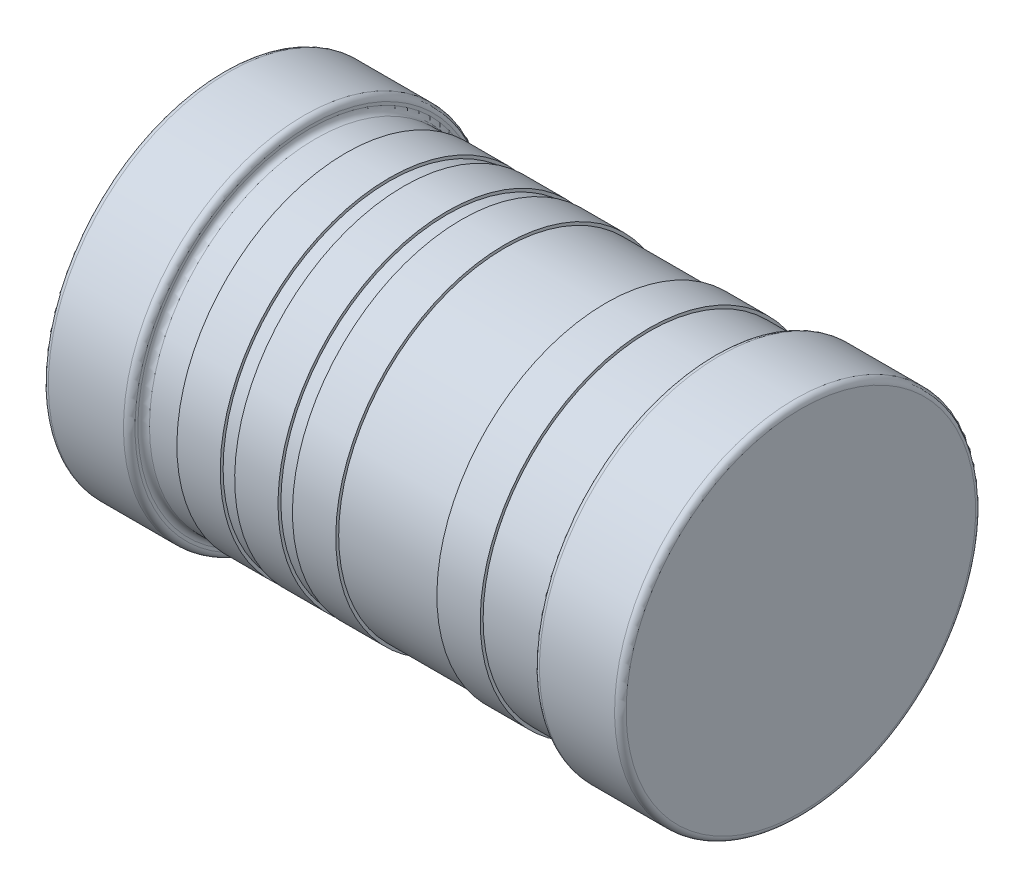
ISO-10303-21;
HEADER;
FILE_DESCRIPTION(('STEP AP214'),'2;1');
FILE_NAME('part.step','',(''),(''),'','','');
FILE_SCHEMA(('AUTOMOTIVE_DESIGN { 1 0 10303 214 1 1 1 1 }'));
ENDSEC;
DATA;
#1=APPLICATION_CONTEXT('core data for automotive mechanical design processes');
#2=APPLICATION_PROTOCOL_DEFINITION('international standard','automotive_design',2000,#1);
#3=PRODUCT_CONTEXT('',#1,'mechanical');
#4=PRODUCT('Part','Part','',(#3));
#5=PRODUCT_RELATED_PRODUCT_CATEGORY('part','',(#4));
#6=PRODUCT_DEFINITION_FORMATION('','',#4);
#7=PRODUCT_DEFINITION_CONTEXT('part definition',#1,'design');
#8=PRODUCT_DEFINITION('design','',#6,#7);
#9=PRODUCT_DEFINITION_SHAPE('','',#8);
#10=(LENGTH_UNIT() NAMED_UNIT(*) SI_UNIT(.MILLI.,.METRE.));
#11=(NAMED_UNIT(*) PLANE_ANGLE_UNIT() SI_UNIT($,.RADIAN.));
#12=(NAMED_UNIT(*) SI_UNIT($,.STERADIAN.) SOLID_ANGLE_UNIT());
#13=UNCERTAINTY_MEASURE_WITH_UNIT(LENGTH_MEASURE(1.E-05),#10,'distance_accuracy_value','');
#14=(GEOMETRIC_REPRESENTATION_CONTEXT(3) GLOBAL_UNCERTAINTY_ASSIGNED_CONTEXT((#13)) GLOBAL_UNIT_ASSIGNED_CONTEXT((#10,
#11,#12)) REPRESENTATION_CONTEXT('',''));
#15=CARTESIAN_POINT('',(0.,0.,0.));
#16=DIRECTION('',(0.,0.,1.));
#17=DIRECTION('',(1.,0.,0.));
#18=AXIS2_PLACEMENT_3D('',#15,#16,#17);
#19=CARTESIAN_POINT('',(-1.,0.0200000000000001,0.));
#20=DIRECTION('',(1.,0.,0.));
#21=DIRECTION('',(0.,1.,0.));
#22=AXIS2_PLACEMENT_3D('',#19,#20,#21);
#23=PLANE('',#22);
#24=CARTESIAN_POINT('',(-1.,0.625,0.));
#25=DIRECTION('',(1.,0.,0.));
#26=DIRECTION('',(0.,1.,0.));
#27=AXIS2_PLACEMENT_3D('',#24,#25,#26);
#28=CIRCLE('',#27,0.605);
#29=CARTESIAN_POINT('',(-1.,1.23,0.));
#30=VERTEX_POINT('',#29);
#31=EDGE_CURVE('E121',#30,#30,#28,.T.);
#32=ORIENTED_EDGE('',*,*,#31,.F.);
#33=EDGE_LOOP('',(#32));
#34=FACE_BOUND('',#33,.T.);
#35=ADVANCED_FACE('F33',(#34),#23,.F.);
#36=CARTESIAN_POINT('',(1.,0.625,0.));
#37=DIRECTION('',(-1.,0.,0.));
#38=DIRECTION('',(0.,-1.,0.));
#39=AXIS2_PLACEMENT_3D('',#36,#37,#38);
#40=PLANE('',#39);
#41=CARTESIAN_POINT('',(1.,0.625,0.));
#42=DIRECTION('',(1.,0.,0.));
#43=DIRECTION('',(0.,1.,0.));
#44=AXIS2_PLACEMENT_3D('',#41,#42,#43);
#45=CIRCLE('',#44,0.605);
#46=CARTESIAN_POINT('',(1.,1.23,0.));
#47=VERTEX_POINT('',#46);
#48=EDGE_CURVE('E10',#47,#47,#45,.T.);
#49=ORIENTED_EDGE('',*,*,#48,.T.);
#50=EDGE_LOOP('',(#49));
#51=FACE_BOUND('',#50,.T.);
#52=ADVANCED_FACE('F128',(#51),#40,.F.);
#53=CARTESIAN_POINT('',(0.98,0.625,0.));
#54=DIRECTION('',(1.,0.,0.));
#55=DIRECTION('',(0.,1.,0.));
#56=AXIS2_PLACEMENT_3D('',#53,#54,#55);
#57=TOROIDAL_SURFACE('',#56,0.605,0.0200000000000001);
#58=ORIENTED_EDGE('',*,*,#48,.F.);
#59=EDGE_LOOP('',(#58));
#60=FACE_BOUND('',#59,.T.);
#61=CARTESIAN_POINT('',(0.980000000000001,0.625,0.));
#62=DIRECTION('',(1.,0.,0.));
#63=DIRECTION('',(0.,1.,0.));
#64=AXIS2_PLACEMENT_3D('',#61,#62,#63);
#65=CIRCLE('',#64,0.625);
#66=CARTESIAN_POINT('',(0.980000000000001,1.25,0.));
#67=VERTEX_POINT('',#66);
#68=EDGE_CURVE('E39',#67,#67,#65,.T.);
#69=ORIENTED_EDGE('',*,*,#68,.T.);
#70=EDGE_LOOP('',(#69));
#71=FACE_BOUND('',#70,.T.);
#72=ADVANCED_FACE('F132',(#60,#71),#57,.T.);
#73=CARTESIAN_POINT('',(-1.,0.625,0.));
#74=DIRECTION('',(1.,0.,0.));
#75=DIRECTION('',(0.,1.,0.));
#76=AXIS2_PLACEMENT_3D('',#73,#74,#75);
#77=CYLINDRICAL_SURFACE('',#76,0.625);
#78=ORIENTED_EDGE('',*,*,#68,.F.);
#79=EDGE_LOOP('',(#78));
#80=FACE_BOUND('',#79,.T.);
#81=CARTESIAN_POINT('',(0.72,0.625,0.));
#82=DIRECTION('',(1.,0.,0.));
#83=DIRECTION('',(0.,1.,0.));
#84=AXIS2_PLACEMENT_3D('',#81,#82,#83);
#85=CIRCLE('',#84,0.625);
#86=CARTESIAN_POINT('',(0.72,1.25,0.));
#87=VERTEX_POINT('',#86);
#88=EDGE_CURVE('E43',#87,#87,#85,.T.);
#89=ORIENTED_EDGE('',*,*,#88,.T.);
#90=EDGE_LOOP('',(#89));
#91=FACE_BOUND('',#90,.T.);
#92=ADVANCED_FACE('F136',(#80,#91),#77,.T.);
#93=CARTESIAN_POINT('',(0.72,0.625,0.));
#94=DIRECTION('',(1.,0.,0.));
#95=DIRECTION('',(0.,1.,0.));
#96=AXIS2_PLACEMENT_3D('',#93,#94,#95);
#97=TOROIDAL_SURFACE('',#96,0.605,0.02);
#98=ORIENTED_EDGE('',*,*,#88,.F.);
#99=EDGE_LOOP('',(#98));
#100=FACE_BOUND('',#99,.T.);
#101=CARTESIAN_POINT('',(0.7,0.625,0.));
#102=DIRECTION('',(1.,0.,0.));
#103=DIRECTION('',(0.,1.,0.));
#104=AXIS2_PLACEMENT_3D('',#101,#102,#103);
#105=CIRCLE('',#104,0.605);
#106=CARTESIAN_POINT('',(0.7,1.23,0.));
#107=VERTEX_POINT('',#106);
#108=EDGE_CURVE('E47',#107,#107,#105,.T.);
#109=ORIENTED_EDGE('',*,*,#108,.T.);
#110=EDGE_LOOP('',(#109));
#111=FACE_BOUND('',#110,.T.);
#112=ADVANCED_FACE('F142',(#100,#111),#97,.T.);
#113=CARTESIAN_POINT('',(0.7,0.03,0.));
#114=DIRECTION('',(1.,0.,0.));
#115=DIRECTION('',(0.,1.,0.));
#116=AXIS2_PLACEMENT_3D('',#113,#114,#115);
#117=PLANE('',#116);
#118=ORIENTED_EDGE('',*,*,#108,.F.);
#119=EDGE_LOOP('',(#118));
#120=FACE_BOUND('',#119,.T.);
#121=CARTESIAN_POINT('',(0.7,0.625,0.));
#122=DIRECTION('',(1.,0.,0.));
#123=DIRECTION('',(0.,1.,0.));
#124=AXIS2_PLACEMENT_3D('',#121,#122,#123);
#125=CIRCLE('',#124,0.595);
#126=CARTESIAN_POINT('',(0.7,1.22,0.));
#127=VERTEX_POINT('',#126);
#128=EDGE_CURVE('E52',#127,#127,#125,.T.);
#129=ORIENTED_EDGE('',*,*,#128,.T.);
#130=EDGE_LOOP('',(#129));
#131=FACE_BOUND('',#130,.T.);
#132=ADVANCED_FACE('F146',(#120,#131),#117,.F.);
#133=CARTESIAN_POINT('',(0.68,0.625,0.));
#134=DIRECTION('',(1.,0.,0.));
#135=DIRECTION('',(0.,1.,0.));
#136=AXIS2_PLACEMENT_3D('',#133,#134,#135);
#137=TOROIDAL_SURFACE('',#136,0.595,0.02);
#138=ORIENTED_EDGE('',*,*,#128,.F.);
#139=EDGE_LOOP('',(#138));
#140=FACE_BOUND('',#139,.T.);
#141=CARTESIAN_POINT('',(0.68,0.625,0.));
#142=DIRECTION('',(1.,0.,0.));
#143=DIRECTION('',(0.,1.,0.));
#144=AXIS2_PLACEMENT_3D('',#141,#142,#143);
#145=CIRCLE('',#144,0.575);
#146=CARTESIAN_POINT('',(0.68,1.2,0.));
#147=VERTEX_POINT('',#146);
#148=EDGE_CURVE('E55',#147,#147,#145,.T.);
#149=ORIENTED_EDGE('',*,*,#148,.T.);
#150=EDGE_LOOP('',(#149));
#151=FACE_BOUND('',#150,.T.);
#152=ADVANCED_FACE('F150',(#140,#151),#137,.F.);
#153=CARTESIAN_POINT('',(-1.,0.625,0.));
#154=DIRECTION('',(1.,0.,0.));
#155=DIRECTION('',(0.,1.,0.));
#156=AXIS2_PLACEMENT_3D('',#153,#154,#155);
#157=CYLINDRICAL_SURFACE('',#156,0.575);
#158=ORIENTED_EDGE('',*,*,#148,.F.);
#159=EDGE_LOOP('',(#158));
#160=FACE_BOUND('',#159,.T.);
#161=CARTESIAN_POINT('',(0.475,0.625,0.));
#162=DIRECTION('',(1.,0.,0.));
#163=DIRECTION('',(0.,1.,0.));
#164=AXIS2_PLACEMENT_3D('',#161,#162,#163);
#165=CIRCLE('',#164,0.575);
#166=CARTESIAN_POINT('',(0.475,1.2,0.));
#167=VERTEX_POINT('',#166);
#168=EDGE_CURVE('E58',#167,#167,#165,.T.);
#169=ORIENTED_EDGE('',*,*,#168,.T.);
#170=EDGE_LOOP('',(#169));
#171=FACE_BOUND('',#170,.T.);
#172=ADVANCED_FACE('F154',(#160,#171),#157,.T.);
#173=CARTESIAN_POINT('',(0.475,0.05,0.));
#174=DIRECTION('',(-1.,0.,0.));
#175=DIRECTION('',(0.,-1.,0.));
#176=AXIS2_PLACEMENT_3D('',#173,#174,#175);
#177=PLANE('',#176);
#178=ORIENTED_EDGE('',*,*,#168,.F.);
#179=EDGE_LOOP('',(#178));
#180=FACE_BOUND('',#179,.T.);
#181=CARTESIAN_POINT('',(0.475,0.625,0.));
#182=DIRECTION('',(1.,0.,0.));
#183=DIRECTION('',(0.,1.,0.));
#184=AXIS2_PLACEMENT_3D('',#181,#182,#183);
#185=CIRCLE('',#184,0.585);
#186=CARTESIAN_POINT('',(0.475,1.21,0.));
#187=VERTEX_POINT('',#186);
#188=EDGE_CURVE('E61',#187,#187,#185,.T.);
#189=ORIENTED_EDGE('',*,*,#188,.T.);
#190=EDGE_LOOP('',(#189));
#191=FACE_BOUND('',#190,.T.);
#192=ADVANCED_FACE('F158',(#180,#191),#177,.F.);
#193=CARTESIAN_POINT('',(-1.,0.625,0.));
#194=DIRECTION('',(1.,0.,0.));
#195=DIRECTION('',(0.,1.,0.));
#196=AXIS2_PLACEMENT_3D('',#193,#194,#195);
#197=CYLINDRICAL_SURFACE('',#196,0.585);
#198=ORIENTED_EDGE('',*,*,#188,.F.);
#199=EDGE_LOOP('',(#198));
#200=FACE_BOUND('',#199,.T.);
#201=CARTESIAN_POINT('',(0.325,0.625,0.));
#202=DIRECTION('',(1.,0.,0.));
#203=DIRECTION('',(0.,1.,0.));
#204=AXIS2_PLACEMENT_3D('',#201,#202,#203);
#205=CIRCLE('',#204,0.585);
#206=CARTESIAN_POINT('',(0.325,1.21,0.));
#207=VERTEX_POINT('',#206);
#208=EDGE_CURVE('E64',#207,#207,#205,.T.);
#209=ORIENTED_EDGE('',*,*,#208,.T.);
#210=EDGE_LOOP('',(#209));
#211=FACE_BOUND('',#210,.T.);
#212=ADVANCED_FACE('F162',(#200,#211),#197,.T.);
#213=CARTESIAN_POINT('',(0.325,0.04,0.));
#214=DIRECTION('',(1.,0.,0.));
#215=DIRECTION('',(0.,1.,0.));
#216=AXIS2_PLACEMENT_3D('',#213,#214,#215);
#217=PLANE('',#216);
#218=ORIENTED_EDGE('',*,*,#208,.F.);
#219=EDGE_LOOP('',(#218));
#220=FACE_BOUND('',#219,.T.);
#221=CARTESIAN_POINT('',(0.325,0.625,0.));
#222=DIRECTION('',(1.,0.,0.));
#223=DIRECTION('',(0.,1.,0.));
#224=AXIS2_PLACEMENT_3D('',#221,#222,#223);
#225=CIRCLE('',#224,0.575);
#226=CARTESIAN_POINT('',(0.325,1.2,0.));
#227=VERTEX_POINT('',#226);
#228=EDGE_CURVE('E67',#227,#227,#225,.T.);
#229=ORIENTED_EDGE('',*,*,#228,.T.);
#230=EDGE_LOOP('',(#229));
#231=FACE_BOUND('',#230,.T.);
#232=ADVANCED_FACE('F166',(#220,#231),#217,.F.);
#233=CARTESIAN_POINT('',(-1.,0.625,0.));
#234=DIRECTION('',(1.,0.,0.));
#235=DIRECTION('',(0.,1.,0.));
#236=AXIS2_PLACEMENT_3D('',#233,#234,#235);
#237=CYLINDRICAL_SURFACE('',#236,0.575);
#238=ORIENTED_EDGE('',*,*,#228,.F.);
#239=EDGE_LOOP('',(#238));
#240=FACE_BOUND('',#239,.T.);
#241=CARTESIAN_POINT('',(-0.0250000000000001,0.625,0.));
#242=DIRECTION('',(1.,0.,0.));
#243=DIRECTION('',(0.,1.,0.));
#244=AXIS2_PLACEMENT_3D('',#241,#242,#243);
#245=CIRCLE('',#244,0.575);
#246=CARTESIAN_POINT('',(-0.025,1.2,0.));
#247=VERTEX_POINT('',#246);
#248=EDGE_CURVE('E70',#247,#247,#245,.T.);
#249=ORIENTED_EDGE('',*,*,#248,.T.);
#250=EDGE_LOOP('',(#249));
#251=FACE_BOUND('',#250,.T.);
#252=ADVANCED_FACE('F170',(#240,#251),#237,.T.);
#253=CARTESIAN_POINT('',(-0.0250000000000001,0.04,0.));
#254=DIRECTION('',(-1.,0.,0.));
#255=DIRECTION('',(0.,-1.,0.));
#256=AXIS2_PLACEMENT_3D('',#253,#254,#255);
#257=PLANE('',#256);
#258=ORIENTED_EDGE('',*,*,#248,.F.);
#259=EDGE_LOOP('',(#258));
#260=FACE_BOUND('',#259,.T.);
#261=CARTESIAN_POINT('',(-0.0250000000000001,0.625,0.));
#262=DIRECTION('',(1.,0.,0.));
#263=DIRECTION('',(0.,1.,0.));
#264=AXIS2_PLACEMENT_3D('',#261,#262,#263);
#265=CIRCLE('',#264,0.585);
#266=CARTESIAN_POINT('',(-0.025,1.21,0.));
#267=VERTEX_POINT('',#266);
#268=EDGE_CURVE('E73',#267,#267,#265,.T.);
#269=ORIENTED_EDGE('',*,*,#268,.T.);
#270=EDGE_LOOP('',(#269));
#271=FACE_BOUND('',#270,.T.);
#272=ADVANCED_FACE('F174',(#260,#271),#257,.F.);
#273=CARTESIAN_POINT('',(-1.,0.625,0.));
#274=DIRECTION('',(1.,0.,0.));
#275=DIRECTION('',(0.,1.,0.));
#276=AXIS2_PLACEMENT_3D('',#273,#274,#275);
#277=CYLINDRICAL_SURFACE('',#276,0.585);
#278=ORIENTED_EDGE('',*,*,#268,.F.);
#279=EDGE_LOOP('',(#278));
#280=FACE_BOUND('',#279,.T.);
#281=CARTESIAN_POINT('',(-0.175,0.625,0.));
#282=DIRECTION('',(1.,0.,0.));
#283=DIRECTION('',(0.,1.,0.));
#284=AXIS2_PLACEMENT_3D('',#281,#282,#283);
#285=CIRCLE('',#284,0.585);
#286=CARTESIAN_POINT('',(-0.175,1.21,0.));
#287=VERTEX_POINT('',#286);
#288=EDGE_CURVE('E76',#287,#287,#285,.T.);
#289=ORIENTED_EDGE('',*,*,#288,.T.);
#290=EDGE_LOOP('',(#289));
#291=FACE_BOUND('',#290,.T.);
#292=ADVANCED_FACE('F178',(#280,#291),#277,.T.);
#293=CARTESIAN_POINT('',(-0.175,0.04,0.));
#294=DIRECTION('',(1.,0.,0.));
#295=DIRECTION('',(0.,1.,0.));
#296=AXIS2_PLACEMENT_3D('',#293,#294,#295);
#297=PLANE('',#296);
#298=ORIENTED_EDGE('',*,*,#288,.F.);
#299=EDGE_LOOP('',(#298));
#300=FACE_BOUND('',#299,.T.);
#301=CARTESIAN_POINT('',(-0.175,0.625,0.));
#302=DIRECTION('',(1.,0.,0.));
#303=DIRECTION('',(0.,1.,0.));
#304=AXIS2_PLACEMENT_3D('',#301,#302,#303);
#305=CIRCLE('',#304,0.575);
#306=CARTESIAN_POINT('',(-0.175,1.2,0.));
#307=VERTEX_POINT('',#306);
#308=EDGE_CURVE('E79',#307,#307,#305,.T.);
#309=ORIENTED_EDGE('',*,*,#308,.T.);
#310=EDGE_LOOP('',(#309));
#311=FACE_BOUND('',#310,.T.);
#312=ADVANCED_FACE('F182',(#300,#311),#297,.F.);
#313=CARTESIAN_POINT('',(-1.,0.625,0.));
#314=DIRECTION('',(1.,0.,0.));
#315=DIRECTION('',(0.,1.,0.));
#316=AXIS2_PLACEMENT_3D('',#313,#314,#315);
#317=CYLINDRICAL_SURFACE('',#316,0.575);
#318=ORIENTED_EDGE('',*,*,#308,.F.);
#319=EDGE_LOOP('',(#318));
#320=FACE_BOUND('',#319,.T.);
#321=CARTESIAN_POINT('',(-0.225,0.625,0.));
#322=DIRECTION('',(1.,0.,0.));
#323=DIRECTION('',(0.,1.,0.));
#324=AXIS2_PLACEMENT_3D('',#321,#322,#323);
#325=CIRCLE('',#324,0.575);
#326=CARTESIAN_POINT('',(-0.225,1.2,0.));
#327=VERTEX_POINT('',#326);
#328=EDGE_CURVE('E82',#327,#327,#325,.T.);
#329=ORIENTED_EDGE('',*,*,#328,.T.);
#330=EDGE_LOOP('',(#329));
#331=FACE_BOUND('',#330,.T.);
#332=ADVANCED_FACE('F186',(#320,#331),#317,.T.);
#333=CARTESIAN_POINT('',(-0.225,0.04,0.));
#334=DIRECTION('',(-1.,0.,0.));
#335=DIRECTION('',(0.,-1.,0.));
#336=AXIS2_PLACEMENT_3D('',#333,#334,#335);
#337=PLANE('',#336);
#338=ORIENTED_EDGE('',*,*,#328,.F.);
#339=EDGE_LOOP('',(#338));
#340=FACE_BOUND('',#339,.T.);
#341=CARTESIAN_POINT('',(-0.225,0.625,0.));
#342=DIRECTION('',(1.,0.,0.));
#343=DIRECTION('',(0.,1.,0.));
#344=AXIS2_PLACEMENT_3D('',#341,#342,#343);
#345=CIRCLE('',#344,0.585);
#346=CARTESIAN_POINT('',(-0.225,1.21,0.));
#347=VERTEX_POINT('',#346);
#348=EDGE_CURVE('E85',#347,#347,#345,.T.);
#349=ORIENTED_EDGE('',*,*,#348,.T.);
#350=EDGE_LOOP('',(#349));
#351=FACE_BOUND('',#350,.T.);
#352=ADVANCED_FACE('F190',(#340,#351),#337,.F.);
#353=CARTESIAN_POINT('',(-1.,0.625,0.));
#354=DIRECTION('',(1.,0.,0.));
#355=DIRECTION('',(0.,1.,0.));
#356=AXIS2_PLACEMENT_3D('',#353,#354,#355);
#357=CYLINDRICAL_SURFACE('',#356,0.585);
#358=ORIENTED_EDGE('',*,*,#348,.F.);
#359=EDGE_LOOP('',(#358));
#360=FACE_BOUND('',#359,.T.);
#361=CARTESIAN_POINT('',(-0.375,0.625,0.));
#362=DIRECTION('',(1.,0.,0.));
#363=DIRECTION('',(0.,1.,0.));
#364=AXIS2_PLACEMENT_3D('',#361,#362,#363);
#365=CIRCLE('',#364,0.585);
#366=CARTESIAN_POINT('',(-0.375,1.21,0.));
#367=VERTEX_POINT('',#366);
#368=EDGE_CURVE('E88',#367,#367,#365,.T.);
#369=ORIENTED_EDGE('',*,*,#368,.T.);
#370=EDGE_LOOP('',(#369));
#371=FACE_BOUND('',#370,.T.);
#372=ADVANCED_FACE('F194',(#360,#371),#357,.T.);
#373=CARTESIAN_POINT('',(-0.375,0.05,0.));
#374=DIRECTION('',(1.,0.,0.));
#375=DIRECTION('',(0.,1.,0.));
#376=AXIS2_PLACEMENT_3D('',#373,#374,#375);
#377=PLANE('',#376);
#378=ORIENTED_EDGE('',*,*,#368,.F.);
#379=EDGE_LOOP('',(#378));
#380=FACE_BOUND('',#379,.T.);
#381=CARTESIAN_POINT('',(-0.375,0.625,0.));
#382=DIRECTION('',(1.,0.,0.));
#383=DIRECTION('',(0.,1.,0.));
#384=AXIS2_PLACEMENT_3D('',#381,#382,#383);
#385=CIRCLE('',#384,0.575);
#386=CARTESIAN_POINT('',(-0.375,1.2,0.));
#387=VERTEX_POINT('',#386);
#388=EDGE_CURVE('E91',#387,#387,#385,.T.);
#389=ORIENTED_EDGE('',*,*,#388,.T.);
#390=EDGE_LOOP('',(#389));
#391=FACE_BOUND('',#390,.T.);
#392=ADVANCED_FACE('F198',(#380,#391),#377,.F.);
#393=CARTESIAN_POINT('',(-1.,0.625,0.));
#394=DIRECTION('',(1.,0.,0.));
#395=DIRECTION('',(0.,1.,0.));
#396=AXIS2_PLACEMENT_3D('',#393,#394,#395);
#397=CYLINDRICAL_SURFACE('',#396,0.575);
#398=ORIENTED_EDGE('',*,*,#388,.F.);
#399=EDGE_LOOP('',(#398));
#400=FACE_BOUND('',#399,.T.);
#401=CARTESIAN_POINT('',(-0.425,0.625,0.));
#402=DIRECTION('',(1.,0.,0.));
#403=DIRECTION('',(0.,1.,0.));
#404=AXIS2_PLACEMENT_3D('',#401,#402,#403);
#405=CIRCLE('',#404,0.575);
#406=CARTESIAN_POINT('',(-0.425,1.2,0.));
#407=VERTEX_POINT('',#406);
#408=EDGE_CURVE('E94',#407,#407,#405,.T.);
#409=ORIENTED_EDGE('',*,*,#408,.T.);
#410=EDGE_LOOP('',(#409));
#411=FACE_BOUND('',#410,.T.);
#412=ADVANCED_FACE('F202',(#400,#411),#397,.T.);
#413=CARTESIAN_POINT('',(-0.425,0.04,0.));
#414=DIRECTION('',(-1.,0.,0.));
#415=DIRECTION('',(0.,-1.,0.));
#416=AXIS2_PLACEMENT_3D('',#413,#414,#415);
#417=PLANE('',#416);
#418=ORIENTED_EDGE('',*,*,#408,.F.);
#419=EDGE_LOOP('',(#418));
#420=FACE_BOUND('',#419,.T.);
#421=CARTESIAN_POINT('',(-0.425,0.625,0.));
#422=DIRECTION('',(1.,0.,0.));
#423=DIRECTION('',(0.,1.,0.));
#424=AXIS2_PLACEMENT_3D('',#421,#422,#423);
#425=CIRCLE('',#424,0.585);
#426=CARTESIAN_POINT('',(-0.425,1.21,0.));
#427=VERTEX_POINT('',#426);
#428=EDGE_CURVE('E97',#427,#427,#425,.T.);
#429=ORIENTED_EDGE('',*,*,#428,.T.);
#430=EDGE_LOOP('',(#429));
#431=FACE_BOUND('',#430,.T.);
#432=ADVANCED_FACE('F206',(#420,#431),#417,.F.);
#433=CARTESIAN_POINT('',(-1.,0.625,0.));
#434=DIRECTION('',(1.,0.,0.));
#435=DIRECTION('',(0.,1.,0.));
#436=AXIS2_PLACEMENT_3D('',#433,#434,#435);
#437=CYLINDRICAL_SURFACE('',#436,0.585);
#438=ORIENTED_EDGE('',*,*,#428,.F.);
#439=EDGE_LOOP('',(#438));
#440=FACE_BOUND('',#439,.T.);
#441=CARTESIAN_POINT('',(-0.575,0.625,0.));
#442=DIRECTION('',(1.,0.,0.));
#443=DIRECTION('',(0.,1.,0.));
#444=AXIS2_PLACEMENT_3D('',#441,#442,#443);
#445=CIRCLE('',#444,0.585);
#446=CARTESIAN_POINT('',(-0.575,1.21,0.));
#447=VERTEX_POINT('',#446);
#448=EDGE_CURVE('E100',#447,#447,#445,.T.);
#449=ORIENTED_EDGE('',*,*,#448,.T.);
#450=EDGE_LOOP('',(#449));
#451=FACE_BOUND('',#450,.T.);
#452=ADVANCED_FACE('F210',(#440,#451),#437,.T.);
#453=CARTESIAN_POINT('',(-0.575,0.05,0.));
#454=DIRECTION('',(1.,0.,0.));
#455=DIRECTION('',(0.,1.,0.));
#456=AXIS2_PLACEMENT_3D('',#453,#454,#455);
#457=PLANE('',#456);
#458=ORIENTED_EDGE('',*,*,#448,.F.);
#459=EDGE_LOOP('',(#458));
#460=FACE_BOUND('',#459,.T.);
#461=CARTESIAN_POINT('',(-0.575,0.625,0.));
#462=DIRECTION('',(1.,0.,0.));
#463=DIRECTION('',(0.,1.,0.));
#464=AXIS2_PLACEMENT_3D('',#461,#462,#463);
#465=CIRCLE('',#464,0.575);
#466=CARTESIAN_POINT('',(-0.575,1.2,0.));
#467=VERTEX_POINT('',#466);
#468=EDGE_CURVE('E103',#467,#467,#465,.T.);
#469=ORIENTED_EDGE('',*,*,#468,.T.);
#470=EDGE_LOOP('',(#469));
#471=FACE_BOUND('',#470,.T.);
#472=ADVANCED_FACE('F214',(#460,#471),#457,.F.);
#473=CARTESIAN_POINT('',(-1.,0.625,0.));
#474=DIRECTION('',(1.,0.,0.));
#475=DIRECTION('',(0.,1.,0.));
#476=AXIS2_PLACEMENT_3D('',#473,#474,#475);
#477=CYLINDRICAL_SURFACE('',#476,0.575);
#478=ORIENTED_EDGE('',*,*,#468,.F.);
#479=EDGE_LOOP('',(#478));
#480=FACE_BOUND('',#479,.T.);
#481=CARTESIAN_POINT('',(-0.68,0.625,0.));
#482=DIRECTION('',(1.,0.,0.));
#483=DIRECTION('',(0.,1.,0.));
#484=AXIS2_PLACEMENT_3D('',#481,#482,#483);
#485=CIRCLE('',#484,0.575);
#486=CARTESIAN_POINT('',(-0.68,1.2,0.));
#487=VERTEX_POINT('',#486);
#488=EDGE_CURVE('E106',#487,#487,#485,.T.);
#489=ORIENTED_EDGE('',*,*,#488,.T.);
#490=EDGE_LOOP('',(#489));
#491=FACE_BOUND('',#490,.T.);
#492=ADVANCED_FACE('F218',(#480,#491),#477,.T.);
#493=CARTESIAN_POINT('',(-0.68,0.625,0.));
#494=DIRECTION('',(1.,0.,0.));
#495=DIRECTION('',(0.,1.,0.));
#496=AXIS2_PLACEMENT_3D('',#493,#494,#495);
#497=TOROIDAL_SURFACE('',#496,0.595,0.02);
#498=ORIENTED_EDGE('',*,*,#488,.F.);
#499=EDGE_LOOP('',(#498));
#500=FACE_BOUND('',#499,.T.);
#501=CARTESIAN_POINT('',(-0.7,0.625,0.));
#502=DIRECTION('',(1.,0.,0.));
#503=DIRECTION('',(0.,1.,0.));
#504=AXIS2_PLACEMENT_3D('',#501,#502,#503);
#505=CIRCLE('',#504,0.595);
#506=CARTESIAN_POINT('',(-0.7,1.22,0.));
#507=VERTEX_POINT('',#506);
#508=EDGE_CURVE('E109',#507,#507,#505,.T.);
#509=ORIENTED_EDGE('',*,*,#508,.T.);
#510=EDGE_LOOP('',(#509));
#511=FACE_BOUND('',#510,.T.);
#512=ADVANCED_FACE('F222',(#500,#511),#497,.F.);
#513=CARTESIAN_POINT('',(-0.7,0.02,0.));
#514=DIRECTION('',(-1.,0.,0.));
#515=DIRECTION('',(0.,-1.,0.));
#516=AXIS2_PLACEMENT_3D('',#513,#514,#515);
#517=PLANE('',#516);
#518=ORIENTED_EDGE('',*,*,#508,.F.);
#519=EDGE_LOOP('',(#518));
#520=FACE_BOUND('',#519,.T.);
#521=CARTESIAN_POINT('',(-0.7,0.625,0.));
#522=DIRECTION('',(1.,0.,0.));
#523=DIRECTION('',(0.,1.,0.));
#524=AXIS2_PLACEMENT_3D('',#521,#522,#523);
#525=CIRCLE('',#524,0.605);
#526=CARTESIAN_POINT('',(-0.7,1.23,0.));
#527=VERTEX_POINT('',#526);
#528=EDGE_CURVE('E112',#527,#527,#525,.T.);
#529=ORIENTED_EDGE('',*,*,#528,.T.);
#530=EDGE_LOOP('',(#529));
#531=FACE_BOUND('',#530,.T.);
#532=ADVANCED_FACE('F226',(#520,#531),#517,.F.);
#533=CARTESIAN_POINT('',(-0.72,0.625,0.));
#534=DIRECTION('',(1.,0.,0.));
#535=DIRECTION('',(0.,1.,0.));
#536=AXIS2_PLACEMENT_3D('',#533,#534,#535);
#537=TOROIDAL_SURFACE('',#536,0.605,0.02);
#538=ORIENTED_EDGE('',*,*,#528,.F.);
#539=EDGE_LOOP('',(#538));
#540=FACE_BOUND('',#539,.T.);
#541=CARTESIAN_POINT('',(-0.72,0.625,0.));
#542=DIRECTION('',(1.,0.,0.));
#543=DIRECTION('',(0.,1.,0.));
#544=AXIS2_PLACEMENT_3D('',#541,#542,#543);
#545=CIRCLE('',#544,0.625);
#546=CARTESIAN_POINT('',(-0.72,1.25,0.));
#547=VERTEX_POINT('',#546);
#548=EDGE_CURVE('E115',#547,#547,#545,.T.);
#549=ORIENTED_EDGE('',*,*,#548,.T.);
#550=EDGE_LOOP('',(#549));
#551=FACE_BOUND('',#550,.T.);
#552=ADVANCED_FACE('F230',(#540,#551),#537,.T.);
#553=CARTESIAN_POINT('',(-1.,0.625,0.));
#554=DIRECTION('',(1.,0.,0.));
#555=DIRECTION('',(0.,1.,0.));
#556=AXIS2_PLACEMENT_3D('',#553,#554,#555);
#557=CYLINDRICAL_SURFACE('',#556,0.625);
#558=ORIENTED_EDGE('',*,*,#548,.F.);
#559=EDGE_LOOP('',(#558));
#560=FACE_BOUND('',#559,.T.);
#561=CARTESIAN_POINT('',(-0.980000000000001,0.625,0.));
#562=DIRECTION('',(1.,0.,0.));
#563=DIRECTION('',(0.,1.,0.));
#564=AXIS2_PLACEMENT_3D('',#561,#562,#563);
#565=CIRCLE('',#564,0.625);
#566=CARTESIAN_POINT('',(-0.980000000000001,1.25,0.));
#567=VERTEX_POINT('',#566);
#568=EDGE_CURVE('E118',#567,#567,#565,.T.);
#569=ORIENTED_EDGE('',*,*,#568,.T.);
#570=EDGE_LOOP('',(#569));
#571=FACE_BOUND('',#570,.T.);
#572=ADVANCED_FACE('F234',(#560,#571),#557,.T.);
#573=CARTESIAN_POINT('',(-0.98,0.625,0.));
#574=DIRECTION('',(1.,0.,0.));
#575=DIRECTION('',(0.,1.,0.));
#576=AXIS2_PLACEMENT_3D('',#573,#574,#575);
#577=TOROIDAL_SURFACE('',#576,0.605,0.0200000000000001);
#578=ORIENTED_EDGE('',*,*,#568,.F.);
#579=EDGE_LOOP('',(#578));
#580=FACE_BOUND('',#579,.T.);
#581=ORIENTED_EDGE('',*,*,#31,.T.);
#582=EDGE_LOOP('',(#581));
#583=FACE_BOUND('',#582,.T.);
#584=ADVANCED_FACE('F125',(#580,#583),#577,.T.);
#585=CLOSED_SHELL('',(#35,#52,#72,#92,#112,#132,#152,#172,#192,#212,#232,#252,#272,#292,#312,
#332,#352,#372,#392,#412,#432,#452,#472,#492,#512,#532,#552,#572,#584));
#586=MANIFOLD_SOLID_BREP('B2',#585);
#587=ADVANCED_BREP_SHAPE_REPRESENTATION('',(#18,#586),#14);
#588=SHAPE_DEFINITION_REPRESENTATION(#9,#587);
ENDSEC;
END-ISO-10303-21;
